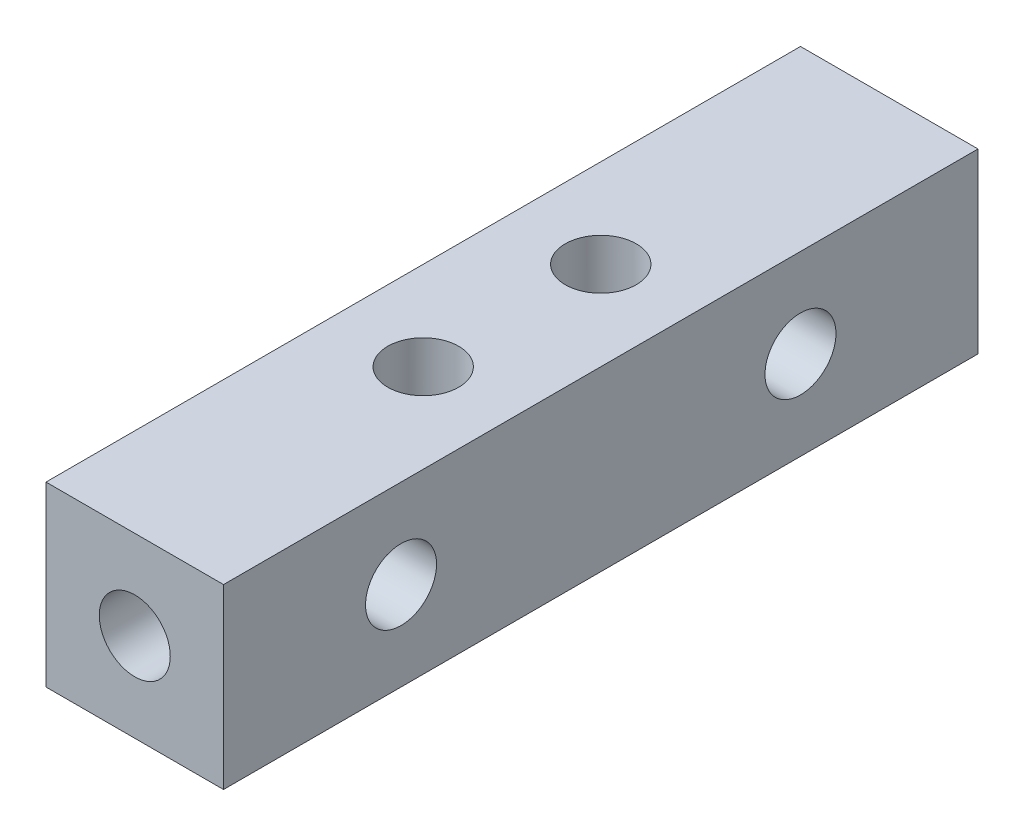
ISO-10303-21;
HEADER;
FILE_DESCRIPTION(('STEP AP214'),'2;1');
FILE_NAME('part.step','',(''),(''),'','','');
FILE_SCHEMA(('AUTOMOTIVE_DESIGN { 1 0 10303 214 1 1 1 1 }'));
ENDSEC;
DATA;
#1=APPLICATION_CONTEXT('core data for automotive mechanical design processes');
#2=APPLICATION_PROTOCOL_DEFINITION('international standard','automotive_design',2000,#1);
#3=PRODUCT_CONTEXT('',#1,'mechanical');
#4=PRODUCT('Part','Part','',(#3));
#5=PRODUCT_RELATED_PRODUCT_CATEGORY('part','',(#4));
#6=PRODUCT_DEFINITION_FORMATION('','',#4);
#7=PRODUCT_DEFINITION_CONTEXT('part definition',#1,'design');
#8=PRODUCT_DEFINITION('design','',#6,#7);
#9=PRODUCT_DEFINITION_SHAPE('','',#8);
#10=(LENGTH_UNIT() NAMED_UNIT(*) SI_UNIT(.MILLI.,.METRE.));
#11=(NAMED_UNIT(*) PLANE_ANGLE_UNIT() SI_UNIT($,.RADIAN.));
#12=(NAMED_UNIT(*) SI_UNIT($,.STERADIAN.) SOLID_ANGLE_UNIT());
#13=UNCERTAINTY_MEASURE_WITH_UNIT(LENGTH_MEASURE(1.E-05),#10,'distance_accuracy_value','');
#14=(GEOMETRIC_REPRESENTATION_CONTEXT(3) GLOBAL_UNCERTAINTY_ASSIGNED_CONTEXT((#13)) GLOBAL_UNIT_ASSIGNED_CONTEXT((#10,
#11,#12)) REPRESENTATION_CONTEXT('',''));
#15=CARTESIAN_POINT('',(0.,0.,0.));
#16=DIRECTION('',(0.,0.,1.));
#17=DIRECTION('',(1.,0.,0.));
#18=AXIS2_PLACEMENT_3D('',#15,#16,#17);
#19=CARTESIAN_POINT('',(5.8325113465929,6.30529085336808,0.));
#20=DIRECTION('',(0.,0.,1.));
#21=DIRECTION('',(1.,0.,0.));
#22=AXIS2_PLACEMENT_3D('',#19,#20,#21);
#23=CYLINDRICAL_SURFACE('',#22,1.6);
#24=CARTESIAN_POINT('',(5.8325113465929,6.30529085336808,34.));
#25=DIRECTION('',(0.,0.,1.));
#26=DIRECTION('',(1.,0.,0.));
#27=AXIS2_PLACEMENT_3D('',#24,#25,#26);
#28=CIRCLE('',#27,1.6);
#29=CARTESIAN_POINT('',(7.4325113465929,6.30529085336808,34.));
#30=VERTEX_POINT('',#29);
#31=EDGE_CURVE('E166',#30,#30,#28,.T.);
#32=ORIENTED_EDGE('',*,*,#31,.T.);
#33=EDGE_LOOP('',(#32));
#34=FACE_BOUND('',#33,.T.);
#35=CARTESIAN_POINT('',(5.8325113465929,6.30529085336808,26.));
#36=DIRECTION('',(-0.707106781186547,0.,0.707106781186547));
#37=DIRECTION('',(0.707106781186547,0.,0.707106781186547));
#38=AXIS2_PLACEMENT_3D('',#35,#36,#37);
#39=ELLIPSE('',#38,2.26274169979695,1.6);
#40=CARTESIAN_POINT('',(5.8325113465929,7.90529085336808,26.));
#41=VERTEX_POINT('',#40);
#42=CARTESIAN_POINT('',(5.8325113465929,4.70529085336808,26.));
#43=VERTEX_POINT('',#42);
#44=EDGE_CURVE('E48',#41,#43,#39,.F.);
#45=ORIENTED_EDGE('',*,*,#44,.T.);
#46=CARTESIAN_POINT('',(5.8325113465929,6.30529085336808,26.));
#47=DIRECTION('',(0.707106781186547,0.,0.707106781186547));
#48=DIRECTION('',(-0.707106781186547,0.,0.707106781186547));
#49=AXIS2_PLACEMENT_3D('',#46,#47,#48);
#50=ELLIPSE('',#49,2.26274169979695,1.6);
#51=EDGE_CURVE('E181',#43,#41,#50,.F.);
#52=ORIENTED_EDGE('',*,*,#51,.T.);
#53=EDGE_LOOP('',(#45,#52));
#54=FACE_BOUND('',#53,.T.);
#55=ADVANCED_FACE('F34',(#34,#54),#23,.F.);
#56=CARTESIAN_POINT('',(5.8325113465929,6.30529085336808,13.));
#57=DIRECTION('',(0.,-0.707106781186547,0.707106781186547));
#58=DIRECTION('',(0.,0.707106781186547,0.707106781186547));
#59=AXIS2_PLACEMENT_3D('',#56,#57,#58);
#60=ELLIPSE('',#59,2.26274169979695,1.6);
#61=CARTESIAN_POINT('',(4.23251134659291,6.30529085336808,13.));
#62=VERTEX_POINT('',#61);
#63=CARTESIAN_POINT('',(7.4325113465929,6.30529085336808,13.));
#64=VERTEX_POINT('',#63);
#65=EDGE_CURVE('E119',#62,#64,#60,.T.);
#66=ORIENTED_EDGE('',*,*,#65,.T.);
#67=CARTESIAN_POINT('',(5.8325113465929,6.30529085336808,13.));
#68=DIRECTION('',(0.,0.707106781186547,0.707106781186547));
#69=DIRECTION('',(0.,-0.707106781186547,0.707106781186547));
#70=AXIS2_PLACEMENT_3D('',#67,#68,#69);
#71=ELLIPSE('',#70,2.26274169979695,1.6);
#72=EDGE_CURVE('E116',#64,#62,#71,.T.);
#73=ORIENTED_EDGE('',*,*,#72,.T.);
#74=EDGE_LOOP('',(#66,#73));
#75=FACE_BOUND('',#74,.T.);
#76=CARTESIAN_POINT('',(5.8325113465929,6.30529085336808,8.));
#77=DIRECTION('',(-0.707106781186547,0.,0.707106781186547));
#78=DIRECTION('',(0.707106781186547,0.,0.707106781186547));
#79=AXIS2_PLACEMENT_3D('',#76,#77,#78);
#80=ELLIPSE('',#79,2.26274169979695,1.6);
#81=CARTESIAN_POINT('',(5.8325113465929,7.90529085336808,8.));
#82=VERTEX_POINT('',#81);
#83=CARTESIAN_POINT('',(5.8325113465929,4.70529085336808,8.));
#84=VERTEX_POINT('',#83);
#85=EDGE_CURVE('E54',#82,#84,#80,.F.);
#86=ORIENTED_EDGE('',*,*,#85,.T.);
#87=CARTESIAN_POINT('',(5.8325113465929,6.30529085336808,8.));
#88=DIRECTION('',(0.707106781186547,0.,0.707106781186547));
#89=DIRECTION('',(-0.707106781186547,0.,0.707106781186547));
#90=AXIS2_PLACEMENT_3D('',#87,#88,#89);
#91=ELLIPSE('',#90,2.26274169979695,1.6);
#92=EDGE_CURVE('E11',#84,#82,#91,.F.);
#93=ORIENTED_EDGE('',*,*,#92,.T.);
#94=EDGE_LOOP('',(#86,#93));
#95=FACE_BOUND('',#94,.T.);
#96=ADVANCED_FACE('F110',(#75,#95),#23,.F.);
#97=CARTESIAN_POINT('',(5.8325113465929,6.30529085336808,26.));
#98=DIRECTION('',(-0.707106781186547,0.,0.707106781186547));
#99=DIRECTION('',(0.707106781186547,0.,0.707106781186547));
#100=AXIS2_PLACEMENT_3D('',#97,#98,#99);
#101=ELLIPSE('',#100,2.26274169979695,1.6);
#102=EDGE_CURVE('E188',#41,#43,#101,.T.);
#103=ORIENTED_EDGE('',*,*,#102,.T.);
#104=CARTESIAN_POINT('',(5.8325113465929,6.30529085336808,26.));
#105=DIRECTION('',(0.707106781186547,0.,0.707106781186547));
#106=DIRECTION('',(-0.707106781186547,0.,0.707106781186547));
#107=AXIS2_PLACEMENT_3D('',#104,#105,#106);
#108=ELLIPSE('',#107,2.26274169979695,1.6);
#109=EDGE_CURVE('E185',#43,#41,#108,.T.);
#110=ORIENTED_EDGE('',*,*,#109,.T.);
#111=EDGE_LOOP('',(#103,#110));
#112=FACE_BOUND('',#111,.T.);
#113=CARTESIAN_POINT('',(5.8325113465929,6.30529085336808,21.));
#114=DIRECTION('',(0.,-0.707106781186547,0.707106781186547));
#115=DIRECTION('',(0.,0.707106781186547,0.707106781186547));
#116=AXIS2_PLACEMENT_3D('',#113,#114,#115);
#117=ELLIPSE('',#116,2.26274169979695,1.6);
#118=CARTESIAN_POINT('',(4.23251134659291,6.30529085336808,21.));
#119=VERTEX_POINT('',#118);
#120=CARTESIAN_POINT('',(7.4325113465929,6.30529085336808,21.));
#121=VERTEX_POINT('',#120);
#122=EDGE_CURVE('E133',#119,#121,#117,.F.);
#123=ORIENTED_EDGE('',*,*,#122,.T.);
#124=CARTESIAN_POINT('',(5.8325113465929,6.30529085336808,21.));
#125=DIRECTION('',(0.,0.707106781186547,0.707106781186547));
#126=DIRECTION('',(0.,-0.707106781186547,0.707106781186547));
#127=AXIS2_PLACEMENT_3D('',#124,#125,#126);
#128=ELLIPSE('',#127,2.26274169979695,1.6);
#129=EDGE_CURVE('E124',#121,#119,#128,.F.);
#130=ORIENTED_EDGE('',*,*,#129,.T.);
#131=EDGE_LOOP('',(#123,#130));
#132=FACE_BOUND('',#131,.T.);
#133=ADVANCED_FACE('F238',(#112,#132),#23,.F.);
#134=CARTESIAN_POINT('',(1.8325113465929,2.30529085336808,34.));
#135=DIRECTION('',(1.,0.,0.));
#136=DIRECTION('',(0.,1.,0.));
#137=AXIS2_PLACEMENT_3D('',#134,#135,#136);
#138=PLANE('',#137);
#139=CARTESIAN_POINT('',(1.8325113465929,6.30529085336808,26.));
#140=DIRECTION('',(1.,0.,0.));
#141=DIRECTION('',(0.,1.,0.));
#142=AXIS2_PLACEMENT_3D('',#139,#140,#141);
#143=CIRCLE('',#142,1.6);
#144=CARTESIAN_POINT('',(1.8325113465929,7.90529085336808,26.));
#145=VERTEX_POINT('',#144);
#146=EDGE_CURVE('E192',#145,#145,#143,.T.);
#147=ORIENTED_EDGE('',*,*,#146,.T.);
#148=EDGE_LOOP('',(#147));
#149=FACE_BOUND('',#148,.T.);
#150=CARTESIAN_POINT('',(1.8325113465929,6.30529085336808,8.));
#151=DIRECTION('',(1.,0.,0.));
#152=DIRECTION('',(0.,1.,0.));
#153=AXIS2_PLACEMENT_3D('',#150,#151,#152);
#154=CIRCLE('',#153,1.6);
#155=CARTESIAN_POINT('',(1.8325113465929,7.90529085336808,8.));
#156=VERTEX_POINT('',#155);
#157=EDGE_CURVE('E195',#156,#156,#154,.T.);
#158=ORIENTED_EDGE('',*,*,#157,.T.);
#159=EDGE_LOOP('',(#158));
#160=FACE_BOUND('',#159,.T.);
#161=DIRECTION('',(0.,-1.,0.));
#162=VECTOR('',#161,1.);
#163=CARTESIAN_POINT('',(1.8325113465929,2.30529085336808,0.));
#164=LINE('',#163,#162);
#165=CARTESIAN_POINT('',(1.8325113465929,10.3052908533681,0.));
#166=VERTEX_POINT('',#165);
#167=CARTESIAN_POINT('',(1.8325113465929,2.30529085336808,0.));
#168=VERTEX_POINT('',#167);
#169=EDGE_CURVE('E155',#166,#168,#164,.T.);
#170=ORIENTED_EDGE('',*,*,#169,.T.);
#171=DIRECTION('',(0.,0.,-1.));
#172=VECTOR('',#171,1.);
#173=CARTESIAN_POINT('',(1.8325113465929,2.30529085336808,34.));
#174=LINE('',#173,#172);
#175=CARTESIAN_POINT('',(1.8325113465929,2.30529085336808,34.));
#176=VERTEX_POINT('',#175);
#177=EDGE_CURVE('E135',#176,#168,#174,.T.);
#178=ORIENTED_EDGE('',*,*,#177,.F.);
#179=DIRECTION('',(0.,-1.,0.));
#180=VECTOR('',#179,1.);
#181=CARTESIAN_POINT('',(1.8325113465929,2.30529085336808,34.));
#182=LINE('',#181,#180);
#183=CARTESIAN_POINT('',(1.8325113465929,10.3052908533681,34.));
#184=VERTEX_POINT('',#183);
#185=EDGE_CURVE('E150',#184,#176,#182,.T.);
#186=ORIENTED_EDGE('',*,*,#185,.F.);
#187=DIRECTION('',(0.,0.,-1.));
#188=VECTOR('',#187,1.);
#189=CARTESIAN_POINT('',(1.8325113465929,10.3052908533681,34.));
#190=LINE('',#189,#188);
#191=EDGE_CURVE('E144',#184,#166,#190,.T.);
#192=ORIENTED_EDGE('',*,*,#191,.T.);
#193=EDGE_LOOP('',(#170,#178,#186,#192));
#194=FACE_BOUND('',#193,.T.);
#195=ADVANCED_FACE('F36',(#149,#160,#194),#138,.F.);
#196=CARTESIAN_POINT('',(1.8325113465929,2.30529085336808,34.));
#197=DIRECTION('',(0.,1.,0.));
#198=DIRECTION('',(0.,0.,1.));
#199=AXIS2_PLACEMENT_3D('',#196,#197,#198);
#200=PLANE('',#199);
#201=CARTESIAN_POINT('',(5.83251134659291,2.30529085336808,13.));
#202=DIRECTION('',(0.,1.,0.));
#203=DIRECTION('',(0.,0.,1.));
#204=AXIS2_PLACEMENT_3D('',#201,#202,#203);
#205=CIRCLE('',#204,1.6);
#206=CARTESIAN_POINT('',(5.83251134659291,2.30529085336808,14.6));
#207=VERTEX_POINT('',#206);
#208=EDGE_CURVE('E169',#207,#207,#205,.T.);
#209=ORIENTED_EDGE('',*,*,#208,.T.);
#210=EDGE_LOOP('',(#209));
#211=FACE_BOUND('',#210,.T.);
#212=CARTESIAN_POINT('',(5.83251134659291,2.30529085336808,21.));
#213=DIRECTION('',(0.,1.,0.));
#214=DIRECTION('',(0.,0.,1.));
#215=AXIS2_PLACEMENT_3D('',#212,#213,#214);
#216=CIRCLE('',#215,1.6);
#217=CARTESIAN_POINT('',(5.83251134659291,2.30529085336808,22.6));
#218=VERTEX_POINT('',#217);
#219=EDGE_CURVE('E174',#218,#218,#216,.T.);
#220=ORIENTED_EDGE('',*,*,#219,.T.);
#221=EDGE_LOOP('',(#220));
#222=FACE_BOUND('',#221,.T.);
#223=DIRECTION('',(1.,0.,0.));
#224=VECTOR('',#223,1.);
#225=CARTESIAN_POINT('',(1.8325113465929,2.30529085336808,0.));
#226=LINE('',#225,#224);
#227=CARTESIAN_POINT('',(9.8325113465929,2.30529085336808,0.));
#228=VERTEX_POINT('',#227);
#229=EDGE_CURVE('E153',#168,#228,#226,.T.);
#230=ORIENTED_EDGE('',*,*,#229,.T.);
#231=DIRECTION('',(0.,0.,-1.));
#232=VECTOR('',#231,1.);
#233=CARTESIAN_POINT('',(9.8325113465929,2.30529085336808,34.));
#234=LINE('',#233,#232);
#235=CARTESIAN_POINT('',(9.8325113465929,2.30529085336808,34.));
#236=VERTEX_POINT('',#235);
#237=EDGE_CURVE('E138',#236,#228,#234,.T.);
#238=ORIENTED_EDGE('',*,*,#237,.F.);
#239=DIRECTION('',(1.,0.,0.));
#240=VECTOR('',#239,1.);
#241=CARTESIAN_POINT('',(1.8325113465929,2.30529085336808,34.));
#242=LINE('',#241,#240);
#243=EDGE_CURVE('E162',#176,#236,#242,.T.);
#244=ORIENTED_EDGE('',*,*,#243,.F.);
#245=ORIENTED_EDGE('',*,*,#177,.T.);
#246=EDGE_LOOP('',(#230,#238,#244,#245));
#247=FACE_BOUND('',#246,.T.);
#248=ADVANCED_FACE('F212',(#211,#222,#247),#200,.F.);
#249=CARTESIAN_POINT('',(9.8325113465929,2.30529085336808,34.));
#250=DIRECTION('',(-1.,0.,0.));
#251=DIRECTION('',(0.,0.,1.));
#252=AXIS2_PLACEMENT_3D('',#249,#250,#251);
#253=PLANE('',#252);
#254=CARTESIAN_POINT('',(9.8325113465929,6.30529085336808,26.));
#255=DIRECTION('',(1.,0.,0.));
#256=DIRECTION('',(0.,0.,-1.));
#257=AXIS2_PLACEMENT_3D('',#254,#255,#256);
#258=CIRCLE('',#257,1.6);
#259=CARTESIAN_POINT('',(9.8325113465929,6.30529085336808,24.4));
#260=VERTEX_POINT('',#259);
#261=EDGE_CURVE('E198',#260,#260,#258,.T.);
#262=ORIENTED_EDGE('',*,*,#261,.F.);
#263=EDGE_LOOP('',(#262));
#264=FACE_BOUND('',#263,.T.);
#265=CARTESIAN_POINT('',(9.8325113465929,6.30529085336808,8.));
#266=DIRECTION('',(1.,0.,0.));
#267=DIRECTION('',(0.,0.,-1.));
#268=AXIS2_PLACEMENT_3D('',#265,#266,#267);
#269=CIRCLE('',#268,1.6);
#270=CARTESIAN_POINT('',(9.8325113465929,6.30529085336808,6.4));
#271=VERTEX_POINT('',#270);
#272=EDGE_CURVE('E199',#271,#271,#269,.T.);
#273=ORIENTED_EDGE('',*,*,#272,.F.);
#274=EDGE_LOOP('',(#273));
#275=FACE_BOUND('',#274,.T.);
#276=DIRECTION('',(0.,1.,0.));
#277=VECTOR('',#276,1.);
#278=CARTESIAN_POINT('',(9.8325113465929,2.30529085336808,0.));
#279=LINE('',#278,#277);
#280=CARTESIAN_POINT('',(9.8325113465929,10.3052908533681,0.));
#281=VERTEX_POINT('',#280);
#282=EDGE_CURVE('E151',#228,#281,#279,.T.);
#283=ORIENTED_EDGE('',*,*,#282,.T.);
#284=DIRECTION('',(0.,0.,-1.));
#285=VECTOR('',#284,1.);
#286=CARTESIAN_POINT('',(9.8325113465929,10.3052908533681,34.));
#287=LINE('',#286,#285);
#288=CARTESIAN_POINT('',(9.8325113465929,10.3052908533681,34.));
#289=VERTEX_POINT('',#288);
#290=EDGE_CURVE('E141',#289,#281,#287,.T.);
#291=ORIENTED_EDGE('',*,*,#290,.F.);
#292=DIRECTION('',(0.,1.,0.));
#293=VECTOR('',#292,1.);
#294=CARTESIAN_POINT('',(9.8325113465929,2.30529085336808,34.));
#295=LINE('',#294,#293);
#296=EDGE_CURVE('E160',#236,#289,#295,.T.);
#297=ORIENTED_EDGE('',*,*,#296,.F.);
#298=ORIENTED_EDGE('',*,*,#237,.T.);
#299=EDGE_LOOP('',(#283,#291,#297,#298));
#300=FACE_BOUND('',#299,.T.);
#301=ADVANCED_FACE('F208',(#264,#275,#300),#253,.F.);
#302=CARTESIAN_POINT('',(1.8325113465929,10.3052908533681,34.));
#303=DIRECTION('',(0.,-1.,0.));
#304=DIRECTION('',(1.,0.,0.));
#305=AXIS2_PLACEMENT_3D('',#302,#303,#304);
#306=PLANE('',#305);
#307=CARTESIAN_POINT('',(5.8325113465929,10.3052908533681,13.));
#308=DIRECTION('',(0.,1.,0.));
#309=DIRECTION('',(-1.,0.,0.));
#310=AXIS2_PLACEMENT_3D('',#307,#308,#309);
#311=CIRCLE('',#310,1.6);
#312=CARTESIAN_POINT('',(4.2325113465929,10.3052908533681,13.));
#313=VERTEX_POINT('',#312);
#314=EDGE_CURVE('E177',#313,#313,#311,.T.);
#315=ORIENTED_EDGE('',*,*,#314,.F.);
#316=EDGE_LOOP('',(#315));
#317=FACE_BOUND('',#316,.T.);
#318=CARTESIAN_POINT('',(5.8325113465929,10.3052908533681,21.));
#319=DIRECTION('',(0.,1.,0.));
#320=DIRECTION('',(-1.,0.,0.));
#321=AXIS2_PLACEMENT_3D('',#318,#319,#320);
#322=CIRCLE('',#321,1.6);
#323=CARTESIAN_POINT('',(4.2325113465929,10.3052908533681,21.));
#324=VERTEX_POINT('',#323);
#325=EDGE_CURVE('E178',#324,#324,#322,.T.);
#326=ORIENTED_EDGE('',*,*,#325,.F.);
#327=EDGE_LOOP('',(#326));
#328=FACE_BOUND('',#327,.T.);
#329=DIRECTION('',(-1.,0.,0.));
#330=VECTOR('',#329,1.);
#331=CARTESIAN_POINT('',(1.8325113465929,10.3052908533681,0.));
#332=LINE('',#331,#330);
#333=EDGE_CURVE('E148',#281,#166,#332,.T.);
#334=ORIENTED_EDGE('',*,*,#333,.T.);
#335=ORIENTED_EDGE('',*,*,#191,.F.);
#336=DIRECTION('',(-1.,0.,0.));
#337=VECTOR('',#336,1.);
#338=CARTESIAN_POINT('',(1.8325113465929,10.3052908533681,34.));
#339=LINE('',#338,#337);
#340=EDGE_CURVE('E147',#289,#184,#339,.T.);
#341=ORIENTED_EDGE('',*,*,#340,.F.);
#342=ORIENTED_EDGE('',*,*,#290,.T.);
#343=EDGE_LOOP('',(#334,#335,#341,#342));
#344=FACE_BOUND('',#343,.T.);
#345=ADVANCED_FACE('F211',(#317,#328,#344),#306,.F.);
#346=CARTESIAN_POINT('',(0.,0.,34.));
#347=DIRECTION('',(0.,0.,-1.));
#348=DIRECTION('',(-1.,0.,0.));
#349=AXIS2_PLACEMENT_3D('',#346,#347,#348);
#350=PLANE('',#349);
#351=ORIENTED_EDGE('',*,*,#31,.F.);
#352=EDGE_LOOP('',(#351));
#353=FACE_BOUND('',#352,.T.);
#354=ORIENTED_EDGE('',*,*,#185,.T.);
#355=ORIENTED_EDGE('',*,*,#243,.T.);
#356=ORIENTED_EDGE('',*,*,#296,.T.);
#357=ORIENTED_EDGE('',*,*,#340,.T.);
#358=EDGE_LOOP('',(#354,#355,#356,#357));
#359=FACE_BOUND('',#358,.T.);
#360=ADVANCED_FACE('F231',(#353,#359),#350,.F.);
#361=CARTESIAN_POINT('',(0.,0.,0.));
#362=DIRECTION('',(0.,0.,-1.));
#363=DIRECTION('',(-1.,0.,0.));
#364=AXIS2_PLACEMENT_3D('',#361,#362,#363);
#365=PLANE('',#364);
#366=CARTESIAN_POINT('',(5.8325113465929,6.30529085336808,0.));
#367=DIRECTION('',(0.,0.,1.));
#368=DIRECTION('',(1.,0.,0.));
#369=AXIS2_PLACEMENT_3D('',#366,#367,#368);
#370=CIRCLE('',#369,1.6);
#371=CARTESIAN_POINT('',(7.4325113465929,6.30529085336808,0.));
#372=VERTEX_POINT('',#371);
#373=EDGE_CURVE('E158',#372,#372,#370,.T.);
#374=ORIENTED_EDGE('',*,*,#373,.T.);
#375=EDGE_LOOP('',(#374));
#376=FACE_BOUND('',#375,.T.);
#377=ORIENTED_EDGE('',*,*,#169,.F.);
#378=ORIENTED_EDGE('',*,*,#333,.F.);
#379=ORIENTED_EDGE('',*,*,#282,.F.);
#380=ORIENTED_EDGE('',*,*,#229,.F.);
#381=EDGE_LOOP('',(#377,#378,#379,#380));
#382=FACE_BOUND('',#381,.T.);
#383=ADVANCED_FACE('F226',(#376,#382),#365,.T.);
#384=CARTESIAN_POINT('',(5.8325113465929,6.30529085336808,8.));
#385=DIRECTION('',(-0.707106781186547,0.,0.707106781186547));
#386=DIRECTION('',(0.707106781186547,0.,0.707106781186547));
#387=AXIS2_PLACEMENT_3D('',#384,#385,#386);
#388=ELLIPSE('',#387,2.26274169979695,1.6);
#389=EDGE_CURVE('E100',#82,#84,#388,.T.);
#390=ORIENTED_EDGE('',*,*,#389,.T.);
#391=CARTESIAN_POINT('',(5.8325113465929,6.30529085336808,8.));
#392=DIRECTION('',(0.707106781186547,0.,0.707106781186547));
#393=DIRECTION('',(-0.707106781186547,0.,0.707106781186547));
#394=AXIS2_PLACEMENT_3D('',#391,#392,#393);
#395=ELLIPSE('',#394,2.26274169979695,1.6);
#396=EDGE_CURVE('E42',#84,#82,#395,.T.);
#397=ORIENTED_EDGE('',*,*,#396,.T.);
#398=EDGE_LOOP('',(#390,#397));
#399=FACE_BOUND('',#398,.T.);
#400=ORIENTED_EDGE('',*,*,#373,.F.);
#401=EDGE_LOOP('',(#400));
#402=FACE_BOUND('',#401,.T.);
#403=ADVANCED_FACE('F111',(#399,#402),#23,.F.);
#404=CARTESIAN_POINT('',(5.83251134659292,-23.6947091466319,21.));
#405=DIRECTION('',(0.,1.,0.));
#406=DIRECTION('',(-1.,0.,0.));
#407=AXIS2_PLACEMENT_3D('',#404,#405,#406);
#408=CYLINDRICAL_SURFACE('',#407,1.6);
#409=ORIENTED_EDGE('',*,*,#325,.T.);
#410=EDGE_LOOP('',(#409));
#411=FACE_BOUND('',#410,.T.);
#412=ORIENTED_EDGE('',*,*,#122,.F.);
#413=CARTESIAN_POINT('',(5.8325113465929,6.30529085336808,21.));
#414=DIRECTION('',(0.,0.707106781186547,0.707106781186547));
#415=DIRECTION('',(0.,-0.707106781186547,0.707106781186547));
#416=AXIS2_PLACEMENT_3D('',#413,#414,#415);
#417=ELLIPSE('',#416,2.26274169979695,1.6);
#418=EDGE_CURVE('E127',#121,#119,#417,.T.);
#419=ORIENTED_EDGE('',*,*,#418,.F.);
#420=EDGE_LOOP('',(#412,#419));
#421=FACE_BOUND('',#420,.T.);
#422=ADVANCED_FACE('F252',(#411,#421),#408,.F.);
#423=CARTESIAN_POINT('',(5.8325113465929,6.30529085336808,21.));
#424=DIRECTION('',(0.,-0.707106781186547,0.707106781186547));
#425=DIRECTION('',(0.,0.707106781186547,0.707106781186547));
#426=AXIS2_PLACEMENT_3D('',#423,#424,#425);
#427=ELLIPSE('',#426,2.26274169979695,1.6);
#428=EDGE_CURVE('E130',#119,#121,#427,.T.);
#429=ORIENTED_EDGE('',*,*,#428,.T.);
#430=ORIENTED_EDGE('',*,*,#418,.T.);
#431=EDGE_LOOP('',(#429,#430));
#432=FACE_BOUND('',#431,.T.);
#433=CARTESIAN_POINT('',(5.8325113465929,6.30529085336808,13.));
#434=DIRECTION('',(0.,-0.707106781186547,0.707106781186547));
#435=DIRECTION('',(0.,0.707106781186547,0.707106781186547));
#436=AXIS2_PLACEMENT_3D('',#433,#434,#435);
#437=ELLIPSE('',#436,2.26274169979695,1.6);
#438=EDGE_CURVE('E122',#62,#64,#437,.F.);
#439=ORIENTED_EDGE('',*,*,#438,.T.);
#440=CARTESIAN_POINT('',(5.8325113465929,6.30529085336808,13.));
#441=DIRECTION('',(0.,0.707106781186547,0.707106781186547));
#442=DIRECTION('',(0.,-0.707106781186547,0.707106781186547));
#443=AXIS2_PLACEMENT_3D('',#440,#441,#442);
#444=ELLIPSE('',#443,2.26274169979695,1.6);
#445=EDGE_CURVE('E108',#64,#62,#444,.F.);
#446=ORIENTED_EDGE('',*,*,#445,.T.);
#447=EDGE_LOOP('',(#439,#446));
#448=FACE_BOUND('',#447,.T.);
#449=ADVANCED_FACE('F248',(#432,#448),#23,.F.);
#450=ORIENTED_EDGE('',*,*,#428,.F.);
#451=ORIENTED_EDGE('',*,*,#129,.F.);
#452=EDGE_LOOP('',(#450,#451));
#453=FACE_BOUND('',#452,.T.);
#454=ORIENTED_EDGE('',*,*,#219,.F.);
#455=EDGE_LOOP('',(#454));
#456=FACE_BOUND('',#455,.T.);
#457=ADVANCED_FACE('F258',(#453,#456),#408,.F.);
#458=CARTESIAN_POINT('',(5.83251134659292,-23.6947091466319,13.));
#459=DIRECTION('',(0.,1.,0.));
#460=DIRECTION('',(-1.,0.,0.));
#461=AXIS2_PLACEMENT_3D('',#458,#459,#460);
#462=CYLINDRICAL_SURFACE('',#461,1.6);
#463=ORIENTED_EDGE('',*,*,#314,.T.);
#464=EDGE_LOOP('',(#463));
#465=FACE_BOUND('',#464,.T.);
#466=ORIENTED_EDGE('',*,*,#438,.F.);
#467=ORIENTED_EDGE('',*,*,#72,.F.);
#468=EDGE_LOOP('',(#466,#467));
#469=FACE_BOUND('',#468,.T.);
#470=ADVANCED_FACE('F271',(#465,#469),#462,.F.);
#471=ORIENTED_EDGE('',*,*,#65,.F.);
#472=ORIENTED_EDGE('',*,*,#445,.F.);
#473=EDGE_LOOP('',(#471,#472));
#474=FACE_BOUND('',#473,.T.);
#475=ORIENTED_EDGE('',*,*,#208,.F.);
#476=EDGE_LOOP('',(#475));
#477=FACE_BOUND('',#476,.T.);
#478=ADVANCED_FACE('F279',(#474,#477),#462,.F.);
#479=CARTESIAN_POINT('',(-24.1674886534071,6.30529085336808,8.));
#480=DIRECTION('',(1.,0.,0.));
#481=DIRECTION('',(0.,0.,-1.));
#482=AXIS2_PLACEMENT_3D('',#479,#480,#481);
#483=CYLINDRICAL_SURFACE('',#482,1.6);
#484=ORIENTED_EDGE('',*,*,#272,.T.);
#485=EDGE_LOOP('',(#484));
#486=FACE_BOUND('',#485,.T.);
#487=ORIENTED_EDGE('',*,*,#85,.F.);
#488=ORIENTED_EDGE('',*,*,#396,.F.);
#489=EDGE_LOOP('',(#487,#488));
#490=FACE_BOUND('',#489,.T.);
#491=ADVANCED_FACE('F107',(#486,#490),#483,.F.);
#492=ORIENTED_EDGE('',*,*,#389,.F.);
#493=ORIENTED_EDGE('',*,*,#92,.F.);
#494=EDGE_LOOP('',(#492,#493));
#495=FACE_BOUND('',#494,.T.);
#496=ORIENTED_EDGE('',*,*,#157,.F.);
#497=EDGE_LOOP('',(#496));
#498=FACE_BOUND('',#497,.T.);
#499=ADVANCED_FACE('F101',(#495,#498),#483,.F.);
#500=CARTESIAN_POINT('',(-24.1674886534071,6.30529085336808,26.));
#501=DIRECTION('',(1.,0.,0.));
#502=DIRECTION('',(0.,0.,-1.));
#503=AXIS2_PLACEMENT_3D('',#500,#501,#502);
#504=CYLINDRICAL_SURFACE('',#503,1.6);
#505=ORIENTED_EDGE('',*,*,#261,.T.);
#506=EDGE_LOOP('',(#505));
#507=FACE_BOUND('',#506,.T.);
#508=ORIENTED_EDGE('',*,*,#44,.F.);
#509=ORIENTED_EDGE('',*,*,#109,.F.);
#510=EDGE_LOOP('',(#508,#509));
#511=FACE_BOUND('',#510,.T.);
#512=ADVANCED_FACE('F205',(#507,#511),#504,.F.);
#513=ORIENTED_EDGE('',*,*,#146,.F.);
#514=EDGE_LOOP('',(#513));
#515=FACE_BOUND('',#514,.T.);
#516=ORIENTED_EDGE('',*,*,#102,.F.);
#517=ORIENTED_EDGE('',*,*,#51,.F.);
#518=EDGE_LOOP('',(#516,#517));
#519=FACE_BOUND('',#518,.T.);
#520=ADVANCED_FACE('F293',(#515,#519),#504,.F.);
#521=CLOSED_SHELL('',(#55,#96,#133,#195,#248,#301,#345,#360,#383,#403,#422,#449,#457,#470,#478,
#491,#499,#512,#520));
#522=MANIFOLD_SOLID_BREP('B2',#521);
#523=ADVANCED_BREP_SHAPE_REPRESENTATION('',(#18,#522),#14);
#524=SHAPE_DEFINITION_REPRESENTATION(#9,#523);
ENDSEC;
END-ISO-10303-21;
